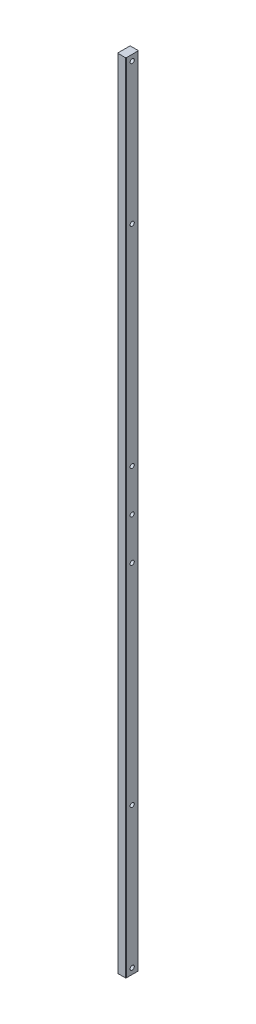
ISO-10303-21;
HEADER;
FILE_DESCRIPTION(('STEP AP214'),'2;1');
FILE_NAME('part.step','',(''),(''),'','','');
FILE_SCHEMA(('AUTOMOTIVE_DESIGN { 1 0 10303 214 1 1 1 1 }'));
ENDSEC;
DATA;
#1=APPLICATION_CONTEXT('core data for automotive mechanical design processes');
#2=APPLICATION_PROTOCOL_DEFINITION('international standard','automotive_design',2000,#1);
#3=PRODUCT_CONTEXT('',#1,'mechanical');
#4=PRODUCT('Part','Part','',(#3));
#5=PRODUCT_RELATED_PRODUCT_CATEGORY('part','',(#4));
#6=PRODUCT_DEFINITION_FORMATION('','',#4);
#7=PRODUCT_DEFINITION_CONTEXT('part definition',#1,'design');
#8=PRODUCT_DEFINITION('design','',#6,#7);
#9=PRODUCT_DEFINITION_SHAPE('','',#8);
#10=(LENGTH_UNIT() NAMED_UNIT(*) SI_UNIT(.MILLI.,.METRE.));
#11=(NAMED_UNIT(*) PLANE_ANGLE_UNIT() SI_UNIT($,.RADIAN.));
#12=(NAMED_UNIT(*) SI_UNIT($,.STERADIAN.) SOLID_ANGLE_UNIT());
#13=UNCERTAINTY_MEASURE_WITH_UNIT(LENGTH_MEASURE(1.E-05),#10,'distance_accuracy_value','');
#14=(GEOMETRIC_REPRESENTATION_CONTEXT(3) GLOBAL_UNCERTAINTY_ASSIGNED_CONTEXT((#13)) GLOBAL_UNIT_ASSIGNED_CONTEXT((#10,
#11,#12)) REPRESENTATION_CONTEXT('',''));
#15=CARTESIAN_POINT('',(0.,0.,0.));
#16=DIRECTION('',(0.,0.,1.));
#17=DIRECTION('',(1.,0.,0.));
#18=AXIS2_PLACEMENT_3D('',#15,#16,#17);
#19=CARTESIAN_POINT('',(10.,950.,13.75));
#20=DIRECTION('',(-1.,0.,0.));
#21=DIRECTION('',(0.,0.,1.));
#22=AXIS2_PLACEMENT_3D('',#19,#20,#21);
#23=PLANE('',#22);
#24=CARTESIAN_POINT('',(10.,-600.,0.));
#25=DIRECTION('',(-1.,0.,0.));
#26=DIRECTION('',(0.,0.,1.));
#27=AXIS2_PLACEMENT_3D('',#24,#25,#26);
#28=CIRCLE('',#27,5.);
#29=CARTESIAN_POINT('',(10.,-600.,5.));
#30=VERTEX_POINT('',#29);
#31=EDGE_CURVE('E190',#30,#30,#28,.T.);
#32=ORIENTED_EDGE('',*,*,#31,.T.);
#33=EDGE_LOOP('',(#32));
#34=FACE_BOUND('',#33,.T.);
#35=CARTESIAN_POINT('',(10.,0.,0.));
#36=DIRECTION('',(-1.,0.,0.));
#37=DIRECTION('',(0.,0.,1.));
#38=AXIS2_PLACEMENT_3D('',#35,#36,#37);
#39=CIRCLE('',#38,5.);
#40=CARTESIAN_POINT('',(10.,0.,5.));
#41=VERTEX_POINT('',#40);
#42=EDGE_CURVE('E178',#41,#41,#39,.T.);
#43=ORIENTED_EDGE('',*,*,#42,.T.);
#44=EDGE_LOOP('',(#43));
#45=FACE_BOUND('',#44,.T.);
#46=CARTESIAN_POINT('',(10.,600.,0.));
#47=DIRECTION('',(-1.,0.,0.));
#48=DIRECTION('',(0.,0.,1.));
#49=AXIS2_PLACEMENT_3D('',#46,#47,#48);
#50=CIRCLE('',#49,5.);
#51=CARTESIAN_POINT('',(10.,600.,5.));
#52=VERTEX_POINT('',#51);
#53=EDGE_CURVE('E166',#52,#52,#50,.T.);
#54=ORIENTED_EDGE('',*,*,#53,.T.);
#55=EDGE_LOOP('',(#54));
#56=FACE_BOUND('',#55,.T.);
#57=DIRECTION('',(0.,0.,-1.));
#58=VECTOR('',#57,1.);
#59=CARTESIAN_POINT('',(10.,-950.,13.75));
#60=LINE('',#59,#58);
#61=CARTESIAN_POINT('',(10.,-950.,13.75));
#62=VERTEX_POINT('',#61);
#63=CARTESIAN_POINT('',(10.,-950.,-13.75));
#64=VERTEX_POINT('',#63);
#65=EDGE_CURVE('E121',#62,#64,#60,.T.);
#66=ORIENTED_EDGE('',*,*,#65,.T.);
#67=DIRECTION('',(0.,-1.,0.));
#68=VECTOR('',#67,1.);
#69=CARTESIAN_POINT('',(10.,950.,-13.75));
#70=LINE('',#69,#68);
#71=CARTESIAN_POINT('',(10.,950.,-13.75));
#72=VERTEX_POINT('',#71);
#73=EDGE_CURVE('E132',#72,#64,#70,.T.);
#74=ORIENTED_EDGE('',*,*,#73,.F.);
#75=DIRECTION('',(0.,0.,-1.));
#76=VECTOR('',#75,1.);
#77=CARTESIAN_POINT('',(10.,950.,13.75));
#78=LINE('',#77,#76);
#79=CARTESIAN_POINT('',(10.,950.,13.75));
#80=VERTEX_POINT('',#79);
#81=EDGE_CURVE('E155',#80,#72,#78,.T.);
#82=ORIENTED_EDGE('',*,*,#81,.F.);
#83=DIRECTION('',(0.,-1.,0.));
#84=VECTOR('',#83,1.);
#85=CARTESIAN_POINT('',(10.,950.,13.75));
#86=LINE('',#85,#84);
#87=EDGE_CURVE('E135',#80,#62,#86,.T.);
#88=ORIENTED_EDGE('',*,*,#87,.T.);
#89=EDGE_LOOP('',(#66,#74,#82,#88));
#90=FACE_BOUND('',#89,.T.);
#91=CARTESIAN_POINT('',(10.,936.,0.));
#92=DIRECTION('',(-1.,0.,0.));
#93=DIRECTION('',(0.,0.,1.));
#94=AXIS2_PLACEMENT_3D('',#91,#92,#93);
#95=CIRCLE('',#94,5.);
#96=CARTESIAN_POINT('',(10.,936.,5.));
#97=VERTEX_POINT('',#96);
#98=EDGE_CURVE('E117',#97,#97,#95,.T.);
#99=ORIENTED_EDGE('',*,*,#98,.T.);
#100=EDGE_LOOP('',(#99));
#101=FACE_BOUND('',#100,.T.);
#102=CARTESIAN_POINT('',(10.,100.,0.));
#103=DIRECTION('',(-1.,0.,0.));
#104=DIRECTION('',(0.,0.,1.));
#105=AXIS2_PLACEMENT_3D('',#102,#103,#104);
#106=CIRCLE('',#105,5.);
#107=CARTESIAN_POINT('',(10.,100.,5.));
#108=VERTEX_POINT('',#107);
#109=EDGE_CURVE('E172',#108,#108,#106,.T.);
#110=ORIENTED_EDGE('',*,*,#109,.T.);
#111=EDGE_LOOP('',(#110));
#112=FACE_BOUND('',#111,.T.);
#113=CARTESIAN_POINT('',(10.,-100.,0.));
#114=DIRECTION('',(-1.,0.,0.));
#115=DIRECTION('',(0.,0.,1.));
#116=AXIS2_PLACEMENT_3D('',#113,#114,#115);
#117=CIRCLE('',#116,5.);
#118=CARTESIAN_POINT('',(10.,-100.,5.));
#119=VERTEX_POINT('',#118);
#120=EDGE_CURVE('E184',#119,#119,#117,.T.);
#121=ORIENTED_EDGE('',*,*,#120,.T.);
#122=EDGE_LOOP('',(#121));
#123=FACE_BOUND('',#122,.T.);
#124=CARTESIAN_POINT('',(10.,-936.,0.));
#125=DIRECTION('',(-1.,0.,0.));
#126=DIRECTION('',(0.,0.,1.));
#127=AXIS2_PLACEMENT_3D('',#124,#125,#126);
#128=CIRCLE('',#127,5.);
#129=CARTESIAN_POINT('',(10.,-936.,5.));
#130=VERTEX_POINT('',#129);
#131=EDGE_CURVE('E196',#130,#130,#128,.T.);
#132=ORIENTED_EDGE('',*,*,#131,.T.);
#133=EDGE_LOOP('',(#132));
#134=FACE_BOUND('',#133,.T.);
#135=ADVANCED_FACE('F16',(#34,#45,#56,#90,#101,#112,#123,#134),#23,.F.);
#136=CARTESIAN_POINT('',(-10.,950.,13.75));
#137=DIRECTION('',(1.,0.,0.));
#138=DIRECTION('',(0.,0.,-1.));
#139=AXIS2_PLACEMENT_3D('',#136,#137,#138);
#140=PLANE('',#139);
#141=CARTESIAN_POINT('',(-10.,-600.,0.));
#142=DIRECTION('',(1.,0.,0.));
#143=DIRECTION('',(0.,0.,-1.));
#144=AXIS2_PLACEMENT_3D('',#141,#142,#143);
#145=CIRCLE('',#144,5.);
#146=CARTESIAN_POINT('',(-10.,-600.,-5.));
#147=VERTEX_POINT('',#146);
#148=EDGE_CURVE('E193',#147,#147,#145,.F.);
#149=ORIENTED_EDGE('',*,*,#148,.F.);
#150=EDGE_LOOP('',(#149));
#151=FACE_BOUND('',#150,.T.);
#152=CARTESIAN_POINT('',(-10.,0.,0.));
#153=DIRECTION('',(1.,0.,0.));
#154=DIRECTION('',(0.,0.,-1.));
#155=AXIS2_PLACEMENT_3D('',#152,#153,#154);
#156=CIRCLE('',#155,5.);
#157=CARTESIAN_POINT('',(-10.,0.,-5.));
#158=VERTEX_POINT('',#157);
#159=EDGE_CURVE('E181',#158,#158,#156,.F.);
#160=ORIENTED_EDGE('',*,*,#159,.F.);
#161=EDGE_LOOP('',(#160));
#162=FACE_BOUND('',#161,.T.);
#163=CARTESIAN_POINT('',(-10.,600.,0.));
#164=DIRECTION('',(1.,0.,0.));
#165=DIRECTION('',(0.,0.,-1.));
#166=AXIS2_PLACEMENT_3D('',#163,#164,#165);
#167=CIRCLE('',#166,5.);
#168=CARTESIAN_POINT('',(-10.,600.,-5.));
#169=VERTEX_POINT('',#168);
#170=EDGE_CURVE('E169',#169,#169,#167,.F.);
#171=ORIENTED_EDGE('',*,*,#170,.F.);
#172=EDGE_LOOP('',(#171));
#173=FACE_BOUND('',#172,.T.);
#174=DIRECTION('',(0.,0.,1.));
#175=VECTOR('',#174,1.);
#176=CARTESIAN_POINT('',(-10.,-950.,13.75));
#177=LINE('',#176,#175);
#178=CARTESIAN_POINT('',(-10.,-950.,-13.75));
#179=VERTEX_POINT('',#178);
#180=CARTESIAN_POINT('',(-10.,-950.,13.75));
#181=VERTEX_POINT('',#180);
#182=EDGE_CURVE('E68',#179,#181,#177,.T.);
#183=ORIENTED_EDGE('',*,*,#182,.T.);
#184=DIRECTION('',(0.,-1.,0.));
#185=VECTOR('',#184,1.);
#186=CARTESIAN_POINT('',(-10.,950.,13.75));
#187=LINE('',#186,#185);
#188=CARTESIAN_POINT('',(-10.,950.,13.75));
#189=VERTEX_POINT('',#188);
#190=EDGE_CURVE('E109',#189,#181,#187,.T.);
#191=ORIENTED_EDGE('',*,*,#190,.F.);
#192=DIRECTION('',(0.,0.,1.));
#193=VECTOR('',#192,1.);
#194=CARTESIAN_POINT('',(-10.,950.,13.75));
#195=LINE('',#194,#193);
#196=CARTESIAN_POINT('',(-10.,950.,-13.75));
#197=VERTEX_POINT('',#196);
#198=EDGE_CURVE('E33',#197,#189,#195,.T.);
#199=ORIENTED_EDGE('',*,*,#198,.F.);
#200=DIRECTION('',(0.,-1.,0.));
#201=VECTOR('',#200,1.);
#202=CARTESIAN_POINT('',(-10.,950.,-13.75));
#203=LINE('',#202,#201);
#204=EDGE_CURVE('E105',#197,#179,#203,.T.);
#205=ORIENTED_EDGE('',*,*,#204,.T.);
#206=EDGE_LOOP('',(#183,#191,#199,#205));
#207=FACE_BOUND('',#206,.T.);
#208=CARTESIAN_POINT('',(-10.,936.,0.));
#209=DIRECTION('',(1.,0.,0.));
#210=DIRECTION('',(0.,0.,-1.));
#211=AXIS2_PLACEMENT_3D('',#208,#209,#210);
#212=CIRCLE('',#211,5.);
#213=CARTESIAN_POINT('',(-10.,936.,-5.));
#214=VERTEX_POINT('',#213);
#215=EDGE_CURVE('E163',#214,#214,#212,.F.);
#216=ORIENTED_EDGE('',*,*,#215,.F.);
#217=EDGE_LOOP('',(#216));
#218=FACE_BOUND('',#217,.T.);
#219=CARTESIAN_POINT('',(-10.,100.,0.));
#220=DIRECTION('',(1.,0.,0.));
#221=DIRECTION('',(0.,0.,-1.));
#222=AXIS2_PLACEMENT_3D('',#219,#220,#221);
#223=CIRCLE('',#222,5.);
#224=CARTESIAN_POINT('',(-10.,100.,-5.));
#225=VERTEX_POINT('',#224);
#226=EDGE_CURVE('E175',#225,#225,#223,.F.);
#227=ORIENTED_EDGE('',*,*,#226,.F.);
#228=EDGE_LOOP('',(#227));
#229=FACE_BOUND('',#228,.T.);
#230=CARTESIAN_POINT('',(-10.,-100.,0.));
#231=DIRECTION('',(1.,0.,0.));
#232=DIRECTION('',(0.,0.,-1.));
#233=AXIS2_PLACEMENT_3D('',#230,#231,#232);
#234=CIRCLE('',#233,5.);
#235=CARTESIAN_POINT('',(-10.,-100.,-5.));
#236=VERTEX_POINT('',#235);
#237=EDGE_CURVE('E187',#236,#236,#234,.F.);
#238=ORIENTED_EDGE('',*,*,#237,.F.);
#239=EDGE_LOOP('',(#238));
#240=FACE_BOUND('',#239,.T.);
#241=CARTESIAN_POINT('',(-10.,-936.,0.));
#242=DIRECTION('',(1.,0.,0.));
#243=DIRECTION('',(0.,0.,-1.));
#244=AXIS2_PLACEMENT_3D('',#241,#242,#243);
#245=CIRCLE('',#244,5.);
#246=CARTESIAN_POINT('',(-10.,-936.,-5.));
#247=VERTEX_POINT('',#246);
#248=EDGE_CURVE('E199',#247,#247,#245,.F.);
#249=ORIENTED_EDGE('',*,*,#248,.F.);
#250=EDGE_LOOP('',(#249));
#251=FACE_BOUND('',#250,.T.);
#252=ADVANCED_FACE('F205',(#151,#162,#173,#207,#218,#229,#240,#251),#140,.F.);
#253=CARTESIAN_POINT('',(-8.75,950.,13.75));
#254=DIRECTION('',(0.,1.,0.));
#255=DIRECTION('',(0.,0.,1.));
#256=AXIS2_PLACEMENT_3D('',#253,#254,#255);
#257=PLANE('',#256);
#258=CARTESIAN_POINT('',(-8.75,950.,13.75));
#259=DIRECTION('',(0.,1.,0.));
#260=DIRECTION('',(0.,0.,-1.));
#261=AXIS2_PLACEMENT_3D('',#258,#259,#260);
#262=CIRCLE('',#261,1.25);
#263=CARTESIAN_POINT('',(-8.75,950.,15.));
#264=VERTEX_POINT('',#263);
#265=EDGE_CURVE('E128',#189,#264,#262,.T.);
#266=ORIENTED_EDGE('',*,*,#265,.T.);
#267=DIRECTION('',(1.,0.,0.));
#268=VECTOR('',#267,1.);
#269=CARTESIAN_POINT('',(-8.75,950.,15.));
#270=LINE('',#269,#268);
#271=CARTESIAN_POINT('',(8.75,950.,15.));
#272=VERTEX_POINT('',#271);
#273=EDGE_CURVE('E76',#264,#272,#270,.T.);
#274=ORIENTED_EDGE('',*,*,#273,.T.);
#275=CARTESIAN_POINT('',(8.75,950.,13.75));
#276=DIRECTION('',(0.,1.,0.));
#277=DIRECTION('',(0.,0.,1.));
#278=AXIS2_PLACEMENT_3D('',#275,#276,#277);
#279=CIRCLE('',#278,1.25);
#280=EDGE_CURVE('E143',#272,#80,#279,.T.);
#281=ORIENTED_EDGE('',*,*,#280,.T.);
#282=ORIENTED_EDGE('',*,*,#81,.T.);
#283=CARTESIAN_POINT('',(8.75,950.,-13.75));
#284=DIRECTION('',(0.,1.,0.));
#285=DIRECTION('',(0.,0.,-1.));
#286=AXIS2_PLACEMENT_3D('',#283,#284,#285);
#287=CIRCLE('',#286,1.25);
#288=CARTESIAN_POINT('',(8.75,950.,-15.));
#289=VERTEX_POINT('',#288);
#290=EDGE_CURVE('E95',#72,#289,#287,.T.);
#291=ORIENTED_EDGE('',*,*,#290,.T.);
#292=DIRECTION('',(-1.,0.,0.));
#293=VECTOR('',#292,1.);
#294=CARTESIAN_POINT('',(-8.75,950.,-15.));
#295=LINE('',#294,#293);
#296=CARTESIAN_POINT('',(-8.75,950.,-15.));
#297=VERTEX_POINT('',#296);
#298=EDGE_CURVE('E89',#289,#297,#295,.T.);
#299=ORIENTED_EDGE('',*,*,#298,.T.);
#300=CARTESIAN_POINT('',(-8.75,950.,-13.75));
#301=DIRECTION('',(0.,1.,0.));
#302=DIRECTION('',(0.,0.,-1.));
#303=AXIS2_PLACEMENT_3D('',#300,#301,#302);
#304=CIRCLE('',#303,1.25);
#305=EDGE_CURVE('E93',#297,#197,#304,.T.);
#306=ORIENTED_EDGE('',*,*,#305,.T.);
#307=ORIENTED_EDGE('',*,*,#198,.T.);
#308=EDGE_LOOP('',(#266,#274,#281,#282,#291,#299,#306,#307));
#309=FACE_BOUND('',#308,.T.);
#310=ADVANCED_FACE('F91',(#309),#257,.T.);
#311=CARTESIAN_POINT('',(-8.75,-950.,13.75));
#312=DIRECTION('',(0.,1.,0.));
#313=DIRECTION('',(0.,0.,1.));
#314=AXIS2_PLACEMENT_3D('',#311,#312,#313);
#315=PLANE('',#314);
#316=CARTESIAN_POINT('',(-8.75,-950.,13.75));
#317=DIRECTION('',(0.,1.,0.));
#318=DIRECTION('',(0.,0.,-1.));
#319=AXIS2_PLACEMENT_3D('',#316,#317,#318);
#320=CIRCLE('',#319,1.25);
#321=CARTESIAN_POINT('',(-8.75,-950.,15.));
#322=VERTEX_POINT('',#321);
#323=EDGE_CURVE('E113',#181,#322,#320,.T.);
#324=ORIENTED_EDGE('',*,*,#323,.F.);
#325=ORIENTED_EDGE('',*,*,#182,.F.);
#326=CARTESIAN_POINT('',(-8.75,-950.,-13.75));
#327=DIRECTION('',(0.,1.,0.));
#328=DIRECTION('',(0.,0.,-1.));
#329=AXIS2_PLACEMENT_3D('',#326,#327,#328);
#330=CIRCLE('',#329,1.25);
#331=CARTESIAN_POINT('',(-8.75,-950.,-15.));
#332=VERTEX_POINT('',#331);
#333=EDGE_CURVE('E62',#332,#179,#330,.T.);
#334=ORIENTED_EDGE('',*,*,#333,.F.);
#335=DIRECTION('',(-1.,0.,0.));
#336=VECTOR('',#335,1.);
#337=CARTESIAN_POINT('',(-8.75,-950.,-15.));
#338=LINE('',#337,#336);
#339=CARTESIAN_POINT('',(8.75,-950.,-15.));
#340=VERTEX_POINT('',#339);
#341=EDGE_CURVE('E103',#340,#332,#338,.T.);
#342=ORIENTED_EDGE('',*,*,#341,.F.);
#343=CARTESIAN_POINT('',(8.75,-950.,-13.75));
#344=DIRECTION('',(0.,1.,0.));
#345=DIRECTION('',(0.,0.,-1.));
#346=AXIS2_PLACEMENT_3D('',#343,#344,#345);
#347=CIRCLE('',#346,1.25);
#348=EDGE_CURVE('E123',#64,#340,#347,.T.);
#349=ORIENTED_EDGE('',*,*,#348,.F.);
#350=ORIENTED_EDGE('',*,*,#65,.F.);
#351=CARTESIAN_POINT('',(8.75,-950.,13.75));
#352=DIRECTION('',(0.,1.,0.));
#353=DIRECTION('',(0.,0.,1.));
#354=AXIS2_PLACEMENT_3D('',#351,#352,#353);
#355=CIRCLE('',#354,1.25);
#356=CARTESIAN_POINT('',(8.75,-950.,15.));
#357=VERTEX_POINT('',#356);
#358=EDGE_CURVE('E119',#357,#62,#355,.T.);
#359=ORIENTED_EDGE('',*,*,#358,.F.);
#360=DIRECTION('',(1.,0.,0.));
#361=VECTOR('',#360,1.);
#362=CARTESIAN_POINT('',(-8.75,-950.,15.));
#363=LINE('',#362,#361);
#364=EDGE_CURVE('E116',#322,#357,#363,.T.);
#365=ORIENTED_EDGE('',*,*,#364,.F.);
#366=EDGE_LOOP('',(#324,#325,#334,#342,#349,#350,#359,#365));
#367=FACE_BOUND('',#366,.T.);
#368=ADVANCED_FACE('F147',(#367),#315,.F.);
#369=CARTESIAN_POINT('',(-8.75,950.,13.75));
#370=DIRECTION('',(0.,-1.,0.));
#371=DIRECTION('',(0.,0.,-1.));
#372=AXIS2_PLACEMENT_3D('',#369,#370,#371);
#373=CYLINDRICAL_SURFACE('',#372,1.25);
#374=ORIENTED_EDGE('',*,*,#323,.T.);
#375=DIRECTION('',(0.,-1.,0.));
#376=VECTOR('',#375,1.);
#377=CARTESIAN_POINT('',(-8.75,950.,15.));
#378=LINE('',#377,#376);
#379=EDGE_CURVE('E11',#264,#322,#378,.T.);
#380=ORIENTED_EDGE('',*,*,#379,.F.);
#381=ORIENTED_EDGE('',*,*,#265,.F.);
#382=ORIENTED_EDGE('',*,*,#190,.T.);
#383=EDGE_LOOP('',(#374,#380,#381,#382));
#384=FACE_BOUND('',#383,.T.);
#385=ADVANCED_FACE('F18',(#384),#373,.T.);
#386=CARTESIAN_POINT('',(-8.75,950.,15.));
#387=DIRECTION('',(0.,0.,-1.));
#388=DIRECTION('',(-1.,0.,0.));
#389=AXIS2_PLACEMENT_3D('',#386,#387,#388);
#390=PLANE('',#389);
#391=ORIENTED_EDGE('',*,*,#364,.T.);
#392=DIRECTION('',(0.,-1.,0.));
#393=VECTOR('',#392,1.);
#394=CARTESIAN_POINT('',(8.75,950.,15.));
#395=LINE('',#394,#393);
#396=EDGE_CURVE('E25',#272,#357,#395,.T.);
#397=ORIENTED_EDGE('',*,*,#396,.F.);
#398=ORIENTED_EDGE('',*,*,#273,.F.);
#399=ORIENTED_EDGE('',*,*,#379,.T.);
#400=EDGE_LOOP('',(#391,#397,#398,#399));
#401=FACE_BOUND('',#400,.T.);
#402=ADVANCED_FACE('F230',(#401),#390,.F.);
#403=CARTESIAN_POINT('',(8.75,950.,13.75));
#404=DIRECTION('',(0.,-1.,0.));
#405=DIRECTION('',(0.,0.,-1.));
#406=AXIS2_PLACEMENT_3D('',#403,#404,#405);
#407=CYLINDRICAL_SURFACE('',#406,1.25);
#408=ORIENTED_EDGE('',*,*,#358,.T.);
#409=ORIENTED_EDGE('',*,*,#87,.F.);
#410=ORIENTED_EDGE('',*,*,#280,.F.);
#411=ORIENTED_EDGE('',*,*,#396,.T.);
#412=EDGE_LOOP('',(#408,#409,#410,#411));
#413=FACE_BOUND('',#412,.T.);
#414=ADVANCED_FACE('F141',(#413),#407,.T.);
#415=CARTESIAN_POINT('',(8.75,950.,-13.75));
#416=DIRECTION('',(0.,-1.,0.));
#417=DIRECTION('',(0.,0.,-1.));
#418=AXIS2_PLACEMENT_3D('',#415,#416,#417);
#419=CYLINDRICAL_SURFACE('',#418,1.25);
#420=ORIENTED_EDGE('',*,*,#348,.T.);
#421=DIRECTION('',(0.,-1.,0.));
#422=VECTOR('',#421,1.);
#423=CARTESIAN_POINT('',(8.75,950.,-15.));
#424=LINE('',#423,#422);
#425=EDGE_CURVE('E104',#289,#340,#424,.T.);
#426=ORIENTED_EDGE('',*,*,#425,.F.);
#427=ORIENTED_EDGE('',*,*,#290,.F.);
#428=ORIENTED_EDGE('',*,*,#73,.T.);
#429=EDGE_LOOP('',(#420,#426,#427,#428));
#430=FACE_BOUND('',#429,.T.);
#431=ADVANCED_FACE('F154',(#430),#419,.T.);
#432=CARTESIAN_POINT('',(-8.75,950.,-15.));
#433=DIRECTION('',(0.,0.,1.));
#434=DIRECTION('',(1.,0.,0.));
#435=AXIS2_PLACEMENT_3D('',#432,#433,#434);
#436=PLANE('',#435);
#437=ORIENTED_EDGE('',*,*,#341,.T.);
#438=DIRECTION('',(0.,-1.,0.));
#439=VECTOR('',#438,1.);
#440=CARTESIAN_POINT('',(-8.75,950.,-15.));
#441=LINE('',#440,#439);
#442=EDGE_CURVE('E100',#297,#332,#441,.T.);
#443=ORIENTED_EDGE('',*,*,#442,.F.);
#444=ORIENTED_EDGE('',*,*,#298,.F.);
#445=ORIENTED_EDGE('',*,*,#425,.T.);
#446=EDGE_LOOP('',(#437,#443,#444,#445));
#447=FACE_BOUND('',#446,.T.);
#448=ADVANCED_FACE('F101',(#447),#436,.F.);
#449=CARTESIAN_POINT('',(-8.75,950.,-13.75));
#450=DIRECTION('',(0.,-1.,0.));
#451=DIRECTION('',(0.,0.,-1.));
#452=AXIS2_PLACEMENT_3D('',#449,#450,#451);
#453=CYLINDRICAL_SURFACE('',#452,1.25);
#454=ORIENTED_EDGE('',*,*,#333,.T.);
#455=ORIENTED_EDGE('',*,*,#204,.F.);
#456=ORIENTED_EDGE('',*,*,#305,.F.);
#457=ORIENTED_EDGE('',*,*,#442,.T.);
#458=EDGE_LOOP('',(#454,#455,#456,#457));
#459=FACE_BOUND('',#458,.T.);
#460=ADVANCED_FACE('F107',(#459),#453,.T.);
#461=CARTESIAN_POINT('',(10.001,936.,0.));
#462=DIRECTION('',(-1.,0.,0.));
#463=DIRECTION('',(0.,0.,1.));
#464=AXIS2_PLACEMENT_3D('',#461,#462,#463);
#465=CYLINDRICAL_SURFACE('',#464,5.);
#466=ORIENTED_EDGE('',*,*,#98,.F.);
#467=EDGE_LOOP('',(#466));
#468=FACE_BOUND('',#467,.T.);
#469=ORIENTED_EDGE('',*,*,#215,.T.);
#470=EDGE_LOOP('',(#469));
#471=FACE_BOUND('',#470,.T.);
#472=ADVANCED_FACE('F224',(#468,#471),#465,.F.);
#473=CARTESIAN_POINT('',(10.001,600.,0.));
#474=DIRECTION('',(-1.,0.,0.));
#475=DIRECTION('',(0.,0.,1.));
#476=AXIS2_PLACEMENT_3D('',#473,#474,#475);
#477=CYLINDRICAL_SURFACE('',#476,5.);
#478=ORIENTED_EDGE('',*,*,#53,.F.);
#479=EDGE_LOOP('',(#478));
#480=FACE_BOUND('',#479,.T.);
#481=ORIENTED_EDGE('',*,*,#170,.T.);
#482=EDGE_LOOP('',(#481));
#483=FACE_BOUND('',#482,.T.);
#484=ADVANCED_FACE('F267',(#480,#483),#477,.F.);
#485=CARTESIAN_POINT('',(10.001,100.,0.));
#486=DIRECTION('',(-1.,0.,0.));
#487=DIRECTION('',(0.,0.,1.));
#488=AXIS2_PLACEMENT_3D('',#485,#486,#487);
#489=CYLINDRICAL_SURFACE('',#488,5.);
#490=ORIENTED_EDGE('',*,*,#109,.F.);
#491=EDGE_LOOP('',(#490));
#492=FACE_BOUND('',#491,.T.);
#493=ORIENTED_EDGE('',*,*,#226,.T.);
#494=EDGE_LOOP('',(#493));
#495=FACE_BOUND('',#494,.T.);
#496=ADVANCED_FACE('F259',(#492,#495),#489,.F.);
#497=CARTESIAN_POINT('',(10.001,0.,0.));
#498=DIRECTION('',(-1.,0.,0.));
#499=DIRECTION('',(0.,0.,1.));
#500=AXIS2_PLACEMENT_3D('',#497,#498,#499);
#501=CYLINDRICAL_SURFACE('',#500,5.);
#502=ORIENTED_EDGE('',*,*,#42,.F.);
#503=EDGE_LOOP('',(#502));
#504=FACE_BOUND('',#503,.T.);
#505=ORIENTED_EDGE('',*,*,#159,.T.);
#506=EDGE_LOOP('',(#505));
#507=FACE_BOUND('',#506,.T.);
#508=ADVANCED_FACE('F249',(#504,#507),#501,.F.);
#509=CARTESIAN_POINT('',(10.001,-100.,0.));
#510=DIRECTION('',(-1.,0.,0.));
#511=DIRECTION('',(0.,0.,1.));
#512=AXIS2_PLACEMENT_3D('',#509,#510,#511);
#513=CYLINDRICAL_SURFACE('',#512,5.);
#514=ORIENTED_EDGE('',*,*,#120,.F.);
#515=EDGE_LOOP('',(#514));
#516=FACE_BOUND('',#515,.T.);
#517=ORIENTED_EDGE('',*,*,#237,.T.);
#518=EDGE_LOOP('',(#517));
#519=FACE_BOUND('',#518,.T.);
#520=ADVANCED_FACE('F246',(#516,#519),#513,.F.);
#521=CARTESIAN_POINT('',(10.001,-600.,0.));
#522=DIRECTION('',(-1.,0.,0.));
#523=DIRECTION('',(0.,0.,1.));
#524=AXIS2_PLACEMENT_3D('',#521,#522,#523);
#525=CYLINDRICAL_SURFACE('',#524,5.);
#526=ORIENTED_EDGE('',*,*,#31,.F.);
#527=EDGE_LOOP('',(#526));
#528=FACE_BOUND('',#527,.T.);
#529=ORIENTED_EDGE('',*,*,#148,.T.);
#530=EDGE_LOOP('',(#529));
#531=FACE_BOUND('',#530,.T.);
#532=ADVANCED_FACE('F248',(#528,#531),#525,.F.);
#533=CARTESIAN_POINT('',(10.001,-936.,0.));
#534=DIRECTION('',(-1.,0.,0.));
#535=DIRECTION('',(0.,0.,1.));
#536=AXIS2_PLACEMENT_3D('',#533,#534,#535);
#537=CYLINDRICAL_SURFACE('',#536,5.);
#538=ORIENTED_EDGE('',*,*,#131,.F.);
#539=EDGE_LOOP('',(#538));
#540=FACE_BOUND('',#539,.T.);
#541=ORIENTED_EDGE('',*,*,#248,.T.);
#542=EDGE_LOOP('',(#541));
#543=FACE_BOUND('',#542,.T.);
#544=ADVANCED_FACE('F203',(#540,#543),#537,.F.);
#545=CLOSED_SHELL('',(#135,#252,#310,#368,#385,#402,#414,#431,#448,#460,#472,#484,#496,#508,
#520,#532,#544));
#546=MANIFOLD_SOLID_BREP('B1',#545);
#547=ADVANCED_BREP_SHAPE_REPRESENTATION('',(#18,#546),#14);
#548=SHAPE_DEFINITION_REPRESENTATION(#9,#547);
ENDSEC;
END-ISO-10303-21;
